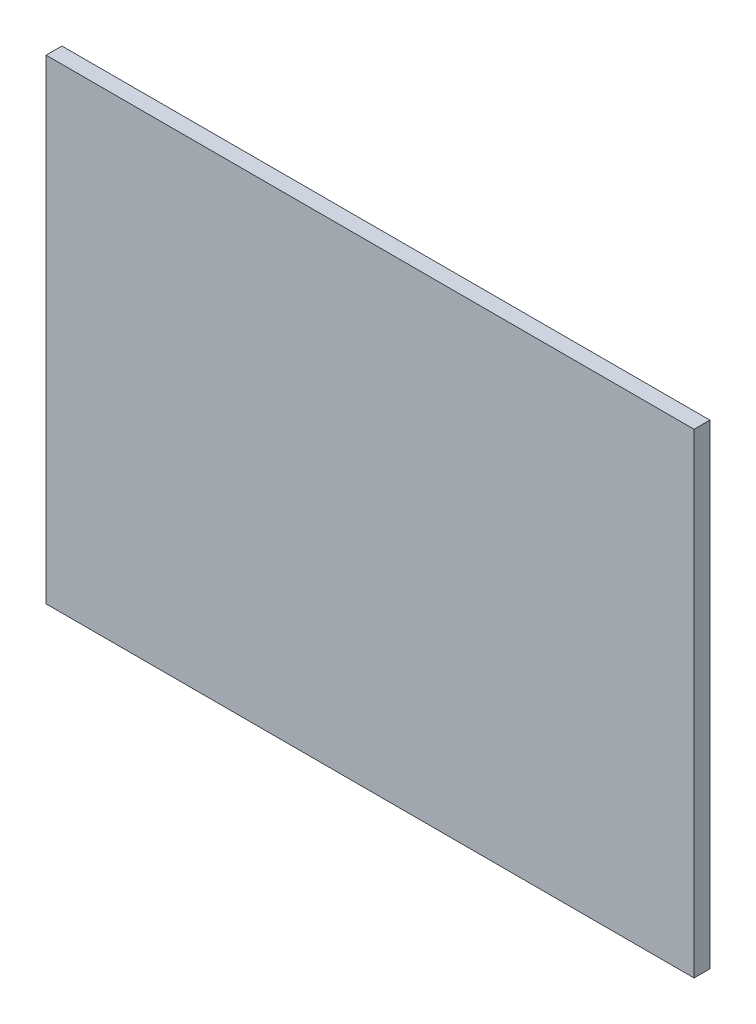
ISO-10303-21;
HEADER;
FILE_DESCRIPTION(('STEP AP214'),'2;1');
FILE_NAME('part.step','',(''),(''),'','','');
FILE_SCHEMA(('AUTOMOTIVE_DESIGN { 1 0 10303 214 1 1 1 1 }'));
ENDSEC;
DATA;
#1=APPLICATION_CONTEXT('core data for automotive mechanical design processes');
#2=APPLICATION_PROTOCOL_DEFINITION('international standard','automotive_design',2000,#1);
#3=PRODUCT_CONTEXT('',#1,'mechanical');
#4=PRODUCT('Part','Part','',(#3));
#5=PRODUCT_RELATED_PRODUCT_CATEGORY('part','',(#4));
#6=PRODUCT_DEFINITION_FORMATION('','',#4);
#7=PRODUCT_DEFINITION_CONTEXT('part definition',#1,'design');
#8=PRODUCT_DEFINITION('design','',#6,#7);
#9=PRODUCT_DEFINITION_SHAPE('','',#8);
#10=(LENGTH_UNIT() NAMED_UNIT(*) SI_UNIT(.MILLI.,.METRE.));
#11=(NAMED_UNIT(*) PLANE_ANGLE_UNIT() SI_UNIT($,.RADIAN.));
#12=(NAMED_UNIT(*) SI_UNIT($,.STERADIAN.) SOLID_ANGLE_UNIT());
#13=UNCERTAINTY_MEASURE_WITH_UNIT(LENGTH_MEASURE(1.E-05),#10,'distance_accuracy_value','');
#14=(GEOMETRIC_REPRESENTATION_CONTEXT(3) GLOBAL_UNCERTAINTY_ASSIGNED_CONTEXT((#13)) GLOBAL_UNIT_ASSIGNED_CONTEXT((#10,
#11,#12)) REPRESENTATION_CONTEXT('',''));
#15=CARTESIAN_POINT('',(0.,0.,0.));
#16=DIRECTION('',(0.,0.,1.));
#17=DIRECTION('',(1.,0.,0.));
#18=AXIS2_PLACEMENT_3D('',#15,#16,#17);
#19=CARTESIAN_POINT('',(0.,0.,5.));
#20=DIRECTION('',(1.,0.,0.));
#21=DIRECTION('',(0.,0.,-1.));
#22=AXIS2_PLACEMENT_3D('',#19,#20,#21);
#23=PLANE('',#22);
#24=DIRECTION('',(0.,-1.,0.));
#25=VECTOR('',#24,1.);
#26=CARTESIAN_POINT('',(0.,0.,0.));
#27=LINE('',#26,#25);
#28=CARTESIAN_POINT('',(0.,150.,0.));
#29=VERTEX_POINT('',#28);
#30=CARTESIAN_POINT('',(0.,0.,0.));
#31=VERTEX_POINT('',#30);
#32=EDGE_CURVE('E95',#29,#31,#27,.T.);
#33=ORIENTED_EDGE('',*,*,#32,.T.);
#34=DIRECTION('',(0.,0.,-1.));
#35=VECTOR('',#34,1.);
#36=CARTESIAN_POINT('',(0.,0.,5.));
#37=LINE('',#36,#35);
#38=CARTESIAN_POINT('',(0.,0.,5.));
#39=VERTEX_POINT('',#38);
#40=EDGE_CURVE('E11',#39,#31,#37,.T.);
#41=ORIENTED_EDGE('',*,*,#40,.F.);
#42=DIRECTION('',(0.,-1.,0.));
#43=VECTOR('',#42,1.);
#44=CARTESIAN_POINT('',(0.,0.,5.));
#45=LINE('',#44,#43);
#46=CARTESIAN_POINT('',(0.,150.,5.));
#47=VERTEX_POINT('',#46);
#48=EDGE_CURVE('E83',#47,#39,#45,.T.);
#49=ORIENTED_EDGE('',*,*,#48,.F.);
#50=DIRECTION('',(0.,0.,-1.));
#51=VECTOR('',#50,1.);
#52=CARTESIAN_POINT('',(0.,150.,5.));
#53=LINE('',#52,#51);
#54=EDGE_CURVE('E91',#47,#29,#53,.T.);
#55=ORIENTED_EDGE('',*,*,#54,.T.);
#56=EDGE_LOOP('',(#33,#41,#49,#55));
#57=FACE_BOUND('',#56,.T.);
#58=ADVANCED_FACE('F32',(#57),#23,.F.);
#59=CARTESIAN_POINT('',(0.,0.,5.));
#60=DIRECTION('',(0.,1.,0.));
#61=DIRECTION('',(0.,0.,1.));
#62=AXIS2_PLACEMENT_3D('',#59,#60,#61);
#63=PLANE('',#62);
#64=DIRECTION('',(1.,0.,0.));
#65=VECTOR('',#64,1.);
#66=CARTESIAN_POINT('',(0.,0.,0.));
#67=LINE('',#66,#65);
#68=CARTESIAN_POINT('',(204.530112698495,0.,0.));
#69=VERTEX_POINT('',#68);
#70=EDGE_CURVE('E87',#31,#69,#67,.T.);
#71=ORIENTED_EDGE('',*,*,#70,.T.);
#72=DIRECTION('',(0.,0.,-1.));
#73=VECTOR('',#72,1.);
#74=CARTESIAN_POINT('',(204.530112698495,0.,5.));
#75=LINE('',#74,#73);
#76=CARTESIAN_POINT('',(204.530112698495,0.,5.));
#77=VERTEX_POINT('',#76);
#78=EDGE_CURVE('E40',#77,#69,#75,.T.);
#79=ORIENTED_EDGE('',*,*,#78,.F.);
#80=DIRECTION('',(1.,0.,0.));
#81=VECTOR('',#80,1.);
#82=CARTESIAN_POINT('',(0.,0.,5.));
#83=LINE('',#82,#81);
#84=EDGE_CURVE('E78',#39,#77,#83,.T.);
#85=ORIENTED_EDGE('',*,*,#84,.F.);
#86=ORIENTED_EDGE('',*,*,#40,.T.);
#87=EDGE_LOOP('',(#71,#79,#85,#86));
#88=FACE_BOUND('',#87,.T.);
#89=ADVANCED_FACE('F86',(#88),#63,.F.);
#90=CARTESIAN_POINT('',(204.530112698495,0.,5.));
#91=DIRECTION('',(-1.,0.,0.));
#92=DIRECTION('',(0.,0.,1.));
#93=AXIS2_PLACEMENT_3D('',#90,#91,#92);
#94=PLANE('',#93);
#95=DIRECTION('',(0.,1.,0.));
#96=VECTOR('',#95,1.);
#97=CARTESIAN_POINT('',(204.530112698495,0.,0.));
#98=LINE('',#97,#96);
#99=CARTESIAN_POINT('',(204.530112698495,150.,0.));
#100=VERTEX_POINT('',#99);
#101=EDGE_CURVE('E65',#69,#100,#98,.T.);
#102=ORIENTED_EDGE('',*,*,#101,.T.);
#103=DIRECTION('',(0.,0.,-1.));
#104=VECTOR('',#103,1.);
#105=CARTESIAN_POINT('',(204.530112698495,150.,5.));
#106=LINE('',#105,#104);
#107=CARTESIAN_POINT('',(204.530112698495,150.,5.));
#108=VERTEX_POINT('',#107);
#109=EDGE_CURVE('E88',#108,#100,#106,.T.);
#110=ORIENTED_EDGE('',*,*,#109,.F.);
#111=DIRECTION('',(0.,1.,0.));
#112=VECTOR('',#111,1.);
#113=CARTESIAN_POINT('',(204.530112698495,0.,5.));
#114=LINE('',#113,#112);
#115=EDGE_CURVE('E81',#77,#108,#114,.T.);
#116=ORIENTED_EDGE('',*,*,#115,.F.);
#117=ORIENTED_EDGE('',*,*,#78,.T.);
#118=EDGE_LOOP('',(#102,#110,#116,#117));
#119=FACE_BOUND('',#118,.T.);
#120=ADVANCED_FACE('F89',(#119),#94,.F.);
#121=CARTESIAN_POINT('',(0.,150.,5.));
#122=DIRECTION('',(0.,-1.,0.));
#123=DIRECTION('',(0.,0.,-1.));
#124=AXIS2_PLACEMENT_3D('',#121,#122,#123);
#125=PLANE('',#124);
#126=DIRECTION('',(-1.,0.,0.));
#127=VECTOR('',#126,1.);
#128=CARTESIAN_POINT('',(0.,150.,0.));
#129=LINE('',#128,#127);
#130=EDGE_CURVE('E71',#100,#29,#129,.T.);
#131=ORIENTED_EDGE('',*,*,#130,.T.);
#132=ORIENTED_EDGE('',*,*,#54,.F.);
#133=DIRECTION('',(-1.,0.,0.));
#134=VECTOR('',#133,1.);
#135=CARTESIAN_POINT('',(0.,150.,5.));
#136=LINE('',#135,#134);
#137=EDGE_CURVE('E48',#108,#47,#136,.T.);
#138=ORIENTED_EDGE('',*,*,#137,.F.);
#139=ORIENTED_EDGE('',*,*,#109,.T.);
#140=EDGE_LOOP('',(#131,#132,#138,#139));
#141=FACE_BOUND('',#140,.T.);
#142=ADVANCED_FACE('F102',(#141),#125,.F.);
#143=CARTESIAN_POINT('',(0.,0.,5.));
#144=DIRECTION('',(0.,0.,-1.));
#145=DIRECTION('',(-1.,0.,0.));
#146=AXIS2_PLACEMENT_3D('',#143,#144,#145);
#147=PLANE('',#146);
#148=ORIENTED_EDGE('',*,*,#48,.T.);
#149=ORIENTED_EDGE('',*,*,#84,.T.);
#150=ORIENTED_EDGE('',*,*,#115,.T.);
#151=ORIENTED_EDGE('',*,*,#137,.T.);
#152=EDGE_LOOP('',(#148,#149,#150,#151));
#153=FACE_BOUND('',#152,.T.);
#154=ADVANCED_FACE('F79',(#153),#147,.F.);
#155=CARTESIAN_POINT('',(0.,0.,0.));
#156=DIRECTION('',(0.,0.,-1.));
#157=DIRECTION('',(-1.,0.,0.));
#158=AXIS2_PLACEMENT_3D('',#155,#156,#157);
#159=PLANE('',#158);
#160=ORIENTED_EDGE('',*,*,#32,.F.);
#161=ORIENTED_EDGE('',*,*,#130,.F.);
#162=ORIENTED_EDGE('',*,*,#101,.F.);
#163=ORIENTED_EDGE('',*,*,#70,.F.);
#164=EDGE_LOOP('',(#160,#161,#162,#163));
#165=FACE_BOUND('',#164,.T.);
#166=ADVANCED_FACE('F105',(#165),#159,.T.);
#167=CLOSED_SHELL('',(#58,#89,#120,#142,#154,#166));
#168=MANIFOLD_SOLID_BREP('B2',#167);
#169=ADVANCED_BREP_SHAPE_REPRESENTATION('',(#18,#168),#14);
#170=SHAPE_DEFINITION_REPRESENTATION(#9,#169);
ENDSEC;
END-ISO-10303-21;
